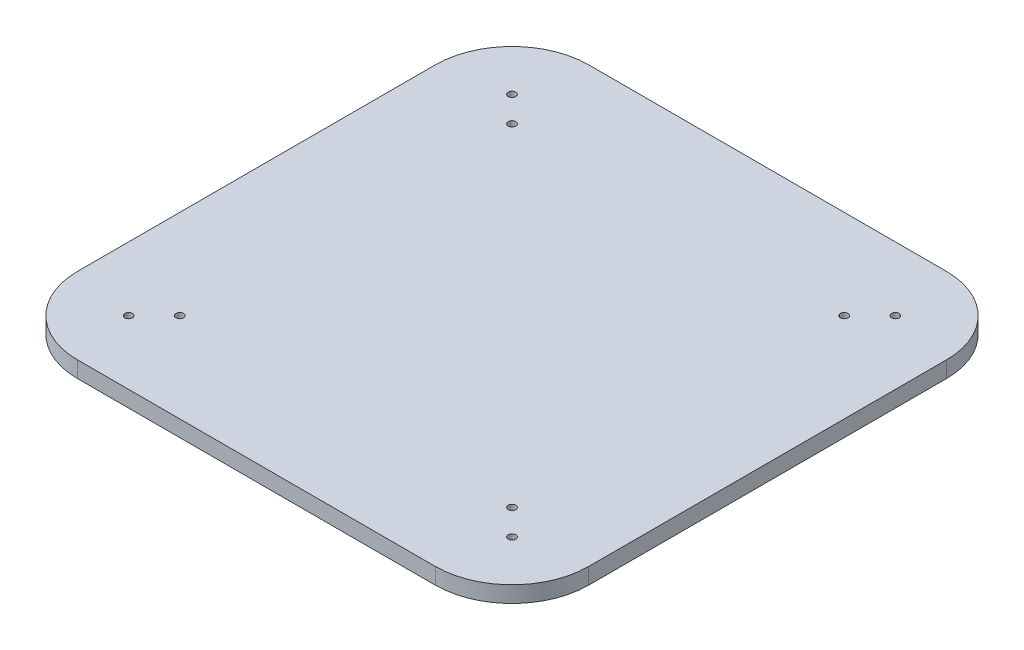
ISO-10303-21;
HEADER;
FILE_DESCRIPTION(('STEP AP214'),'2;1');
FILE_NAME('part.step','',(''),(''),'','','');
FILE_SCHEMA(('AUTOMOTIVE_DESIGN { 1 0 10303 214 1 1 1 1 }'));
ENDSEC;
DATA;
#1=APPLICATION_CONTEXT('core data for automotive mechanical design processes');
#2=APPLICATION_PROTOCOL_DEFINITION('international standard','automotive_design',2000,#1);
#3=PRODUCT_CONTEXT('',#1,'mechanical');
#4=PRODUCT('Part','Part','',(#3));
#5=PRODUCT_RELATED_PRODUCT_CATEGORY('part','',(#4));
#6=PRODUCT_DEFINITION_FORMATION('','',#4);
#7=PRODUCT_DEFINITION_CONTEXT('part definition',#1,'design');
#8=PRODUCT_DEFINITION('design','',#6,#7);
#9=PRODUCT_DEFINITION_SHAPE('','',#8);
#10=(LENGTH_UNIT() NAMED_UNIT(*) SI_UNIT(.MILLI.,.METRE.));
#11=(NAMED_UNIT(*) PLANE_ANGLE_UNIT() SI_UNIT($,.RADIAN.));
#12=(NAMED_UNIT(*) SI_UNIT($,.STERADIAN.) SOLID_ANGLE_UNIT());
#13=UNCERTAINTY_MEASURE_WITH_UNIT(LENGTH_MEASURE(1.E-05),#10,'distance_accuracy_value','');
#14=(GEOMETRIC_REPRESENTATION_CONTEXT(3) GLOBAL_UNCERTAINTY_ASSIGNED_CONTEXT((#13)) GLOBAL_UNIT_ASSIGNED_CONTEXT((#10,
#11,#12)) REPRESENTATION_CONTEXT('',''));
#15=CARTESIAN_POINT('',(0.,0.,0.));
#16=DIRECTION('',(0.,0.,1.));
#17=DIRECTION('',(1.,0.,0.));
#18=AXIS2_PLACEMENT_3D('',#15,#16,#17);
#19=CARTESIAN_POINT('',(70.,6.35,-70.));
#20=DIRECTION('',(0.,1.,0.));
#21=DIRECTION('',(0.,0.,1.));
#22=AXIS2_PLACEMENT_3D('',#19,#20,#21);
#23=PLANE('',#22);
#24=CARTESIAN_POINT('',(-75.0000000000001,6.35,-74.9999999999928));
#25=DIRECTION('',(0.,1.,0.));
#26=DIRECTION('',(0.,0.,1.));
#27=AXIS2_PLACEMENT_3D('',#24,#25,#26);
#28=CIRCLE('',#27,1.50000000000741);
#29=CARTESIAN_POINT('',(-75.0000000000001,6.35,-73.4999999999854));
#30=VERTEX_POINT('',#29);
#31=EDGE_CURVE('E212',#30,#30,#28,.T.);
#32=ORIENTED_EDGE('',*,*,#31,.F.);
#33=EDGE_LOOP('',(#32));
#34=FACE_BOUND('',#33,.T.);
#35=CARTESIAN_POINT('',(-74.9999999999928,6.35,75.0000000000073));
#36=DIRECTION('',(0.,1.,0.));
#37=DIRECTION('',(0.,0.,1.));
#38=AXIS2_PLACEMENT_3D('',#35,#36,#37);
#39=CIRCLE('',#38,1.50000000000514);
#40=CARTESIAN_POINT('',(-74.9999999999928,6.35,76.5000000000124));
#41=VERTEX_POINT('',#40);
#42=EDGE_CURVE('E200',#41,#41,#39,.T.);
#43=ORIENTED_EDGE('',*,*,#42,.F.);
#44=EDGE_LOOP('',(#43));
#45=FACE_BOUND('',#44,.T.);
#46=CARTESIAN_POINT('',(75.0000000000072,6.35,75.));
#47=DIRECTION('',(0.,1.,0.));
#48=DIRECTION('',(0.,0.,1.));
#49=AXIS2_PLACEMENT_3D('',#46,#47,#48);
#50=CIRCLE('',#49,1.49999999999804);
#51=CARTESIAN_POINT('',(75.0000000000072,6.35,76.4999999999981));
#52=VERTEX_POINT('',#51);
#53=EDGE_CURVE('E188',#52,#52,#50,.T.);
#54=ORIENTED_EDGE('',*,*,#53,.F.);
#55=EDGE_LOOP('',(#54));
#56=FACE_BOUND('',#55,.T.);
#57=CARTESIAN_POINT('',(75.,6.35,-75.));
#58=DIRECTION('',(0.,1.,0.));
#59=DIRECTION('',(0.,0.,1.));
#60=AXIS2_PLACEMENT_3D('',#57,#58,#59);
#61=CIRCLE('',#60,1.5);
#62=CARTESIAN_POINT('',(75.,6.35,-73.5));
#63=VERTEX_POINT('',#62);
#64=EDGE_CURVE('E134',#63,#63,#61,.T.);
#65=ORIENTED_EDGE('',*,*,#64,.F.);
#66=EDGE_LOOP('',(#65));
#67=FACE_BOUND('',#66,.T.);
#68=CARTESIAN_POINT('',(70.,6.35,-70.));
#69=DIRECTION('',(0.,1.,0.));
#70=DIRECTION('',(0.,0.,1.));
#71=AXIS2_PLACEMENT_3D('',#68,#69,#70);
#72=CIRCLE('',#71,30.);
#73=CARTESIAN_POINT('',(100.,6.35,-69.9999999999998));
#74=VERTEX_POINT('',#73);
#75=CARTESIAN_POINT('',(69.9999999999998,6.35,-100.));
#76=VERTEX_POINT('',#75);
#77=EDGE_CURVE('E145',#74,#76,#72,.T.);
#78=ORIENTED_EDGE('',*,*,#77,.T.);
#79=DIRECTION('',(-1.,0.,0.));
#80=VECTOR('',#79,1.);
#81=CARTESIAN_POINT('',(-69.9999999999998,6.35,-100.));
#82=LINE('',#81,#80);
#83=CARTESIAN_POINT('',(-70.,6.35,-100.));
#84=VERTEX_POINT('',#83);
#85=EDGE_CURVE('E93',#76,#84,#82,.T.);
#86=ORIENTED_EDGE('',*,*,#85,.T.);
#87=CARTESIAN_POINT('',(-70.,6.35,-70.));
#88=DIRECTION('',(0.,1.,0.));
#89=DIRECTION('',(0.,0.,-1.));
#90=AXIS2_PLACEMENT_3D('',#87,#88,#89);
#91=CIRCLE('',#90,30.);
#92=CARTESIAN_POINT('',(-100.,6.35,-69.9999999999998));
#93=VERTEX_POINT('',#92);
#94=EDGE_CURVE('E160',#84,#93,#91,.T.);
#95=ORIENTED_EDGE('',*,*,#94,.T.);
#96=DIRECTION('',(0.,0.,1.));
#97=VECTOR('',#96,1.);
#98=CARTESIAN_POINT('',(-100.,6.35,-69.9999999999998));
#99=LINE('',#98,#97);
#100=CARTESIAN_POINT('',(-100.,6.35,69.9999999999998));
#101=VERTEX_POINT('',#100);
#102=EDGE_CURVE('E173',#93,#101,#99,.T.);
#103=ORIENTED_EDGE('',*,*,#102,.T.);
#104=CARTESIAN_POINT('',(-70.,6.35,70.));
#105=DIRECTION('',(0.,1.,0.));
#106=DIRECTION('',(0.,0.,1.));
#107=AXIS2_PLACEMENT_3D('',#104,#105,#106);
#108=CIRCLE('',#107,30.);
#109=CARTESIAN_POINT('',(-69.9999999999998,6.35,100.));
#110=VERTEX_POINT('',#109);
#111=EDGE_CURVE('E112',#101,#110,#108,.T.);
#112=ORIENTED_EDGE('',*,*,#111,.T.);
#113=DIRECTION('',(1.,0.,0.));
#114=VECTOR('',#113,1.);
#115=CARTESIAN_POINT('',(-69.9999999999998,6.35,100.));
#116=LINE('',#115,#114);
#117=CARTESIAN_POINT('',(69.9999999999998,6.35,100.));
#118=VERTEX_POINT('',#117);
#119=EDGE_CURVE('E106',#110,#118,#116,.T.);
#120=ORIENTED_EDGE('',*,*,#119,.T.);
#121=CARTESIAN_POINT('',(70.,6.35,70.));
#122=DIRECTION('',(0.,1.,0.));
#123=DIRECTION('',(0.,0.,-1.));
#124=AXIS2_PLACEMENT_3D('',#121,#122,#123);
#125=CIRCLE('',#124,30.);
#126=CARTESIAN_POINT('',(100.,6.35,69.9999999999998));
#127=VERTEX_POINT('',#126);
#128=EDGE_CURVE('E110',#118,#127,#125,.T.);
#129=ORIENTED_EDGE('',*,*,#128,.T.);
#130=DIRECTION('',(0.,0.,-1.));
#131=VECTOR('',#130,1.);
#132=CARTESIAN_POINT('',(100.,6.35,-69.9999999999998));
#133=LINE('',#132,#131);
#134=EDGE_CURVE('E50',#127,#74,#133,.T.);
#135=ORIENTED_EDGE('',*,*,#134,.T.);
#136=EDGE_LOOP('',(#78,#86,#95,#103,#112,#120,#129,#135));
#137=FACE_BOUND('',#136,.T.);
#138=CARTESIAN_POINT('',(65.,6.35,-65.0000000000001));
#139=DIRECTION('',(0.,1.,0.));
#140=DIRECTION('',(0.,0.,1.));
#141=AXIS2_PLACEMENT_3D('',#138,#139,#140);
#142=CIRCLE('',#141,1.5);
#143=CARTESIAN_POINT('',(65.,6.35,-63.5000000000001));
#144=VERTEX_POINT('',#143);
#145=EDGE_CURVE('E182',#144,#144,#142,.T.);
#146=ORIENTED_EDGE('',*,*,#145,.F.);
#147=EDGE_LOOP('',(#146));
#148=FACE_BOUND('',#147,.T.);
#149=CARTESIAN_POINT('',(65.0000000000073,6.35,65.));
#150=DIRECTION('',(0.,1.,0.));
#151=DIRECTION('',(0.,0.,1.));
#152=AXIS2_PLACEMENT_3D('',#149,#150,#151);
#153=CIRCLE('',#152,1.49999999999801);
#154=CARTESIAN_POINT('',(65.0000000000073,6.35,66.499999999998));
#155=VERTEX_POINT('',#154);
#156=EDGE_CURVE('E194',#155,#155,#153,.T.);
#157=ORIENTED_EDGE('',*,*,#156,.F.);
#158=EDGE_LOOP('',(#157));
#159=FACE_BOUND('',#158,.T.);
#160=CARTESIAN_POINT('',(-64.9999999999928,6.35,65.0000000000073));
#161=DIRECTION('',(0.,1.,0.));
#162=DIRECTION('',(0.,0.,1.));
#163=AXIS2_PLACEMENT_3D('',#160,#161,#162);
#164=CIRCLE('',#163,1.50000000000509);
#165=CARTESIAN_POINT('',(-64.9999999999928,6.35,66.5000000000124));
#166=VERTEX_POINT('',#165);
#167=EDGE_CURVE('E206',#166,#166,#164,.T.);
#168=ORIENTED_EDGE('',*,*,#167,.F.);
#169=EDGE_LOOP('',(#168));
#170=FACE_BOUND('',#169,.T.);
#171=CARTESIAN_POINT('',(-65.0000000000001,6.35,-64.9999999999928));
#172=DIRECTION('',(0.,1.,0.));
#173=DIRECTION('',(0.,0.,1.));
#174=AXIS2_PLACEMENT_3D('',#171,#172,#173);
#175=CIRCLE('',#174,1.50000000000734);
#176=CARTESIAN_POINT('',(-65.0000000000001,6.35,-63.4999999999854));
#177=VERTEX_POINT('',#176);
#178=EDGE_CURVE('E218',#177,#177,#175,.T.);
#179=ORIENTED_EDGE('',*,*,#178,.F.);
#180=EDGE_LOOP('',(#179));
#181=FACE_BOUND('',#180,.T.);
#182=ADVANCED_FACE('F33',(#34,#45,#56,#67,#137,#148,#159,#170,#181),#23,.T.);
#183=CARTESIAN_POINT('',(70.,0.,-70.));
#184=DIRECTION('',(0.,1.,0.));
#185=DIRECTION('',(0.,0.,1.));
#186=AXIS2_PLACEMENT_3D('',#183,#184,#185);
#187=PLANE('',#186);
#188=CARTESIAN_POINT('',(70.,0.,-70.));
#189=DIRECTION('',(0.,1.,0.));
#190=DIRECTION('',(0.,0.,1.));
#191=AXIS2_PLACEMENT_3D('',#188,#189,#190);
#192=CIRCLE('',#191,30.);
#193=CARTESIAN_POINT('',(100.,0.,-69.9999999999998));
#194=VERTEX_POINT('',#193);
#195=CARTESIAN_POINT('',(69.9999999999998,0.,-100.));
#196=VERTEX_POINT('',#195);
#197=EDGE_CURVE('E130',#194,#196,#192,.T.);
#198=ORIENTED_EDGE('',*,*,#197,.F.);
#199=DIRECTION('',(0.,0.,-1.));
#200=VECTOR('',#199,1.);
#201=CARTESIAN_POINT('',(100.,0.,-69.9999999999998));
#202=LINE('',#201,#200);
#203=CARTESIAN_POINT('',(100.,0.,69.9999999999998));
#204=VERTEX_POINT('',#203);
#205=EDGE_CURVE('E85',#204,#194,#202,.T.);
#206=ORIENTED_EDGE('',*,*,#205,.F.);
#207=CARTESIAN_POINT('',(70.,0.,70.));
#208=DIRECTION('',(0.,1.,0.));
#209=DIRECTION('',(0.,0.,-1.));
#210=AXIS2_PLACEMENT_3D('',#207,#208,#209);
#211=CIRCLE('',#210,30.);
#212=CARTESIAN_POINT('',(69.9999999999998,0.,100.));
#213=VERTEX_POINT('',#212);
#214=EDGE_CURVE('E79',#213,#204,#211,.T.);
#215=ORIENTED_EDGE('',*,*,#214,.F.);
#216=DIRECTION('',(1.,0.,0.));
#217=VECTOR('',#216,1.);
#218=CARTESIAN_POINT('',(-69.9999999999998,0.,100.));
#219=LINE('',#218,#217);
#220=CARTESIAN_POINT('',(-69.9999999999998,0.,100.));
#221=VERTEX_POINT('',#220);
#222=EDGE_CURVE('E120',#221,#213,#219,.T.);
#223=ORIENTED_EDGE('',*,*,#222,.F.);
#224=CARTESIAN_POINT('',(-70.,0.,70.));
#225=DIRECTION('',(0.,1.,0.));
#226=DIRECTION('',(0.,0.,1.));
#227=AXIS2_PLACEMENT_3D('',#224,#225,#226);
#228=CIRCLE('',#227,30.);
#229=CARTESIAN_POINT('',(-100.,0.,69.9999999999998));
#230=VERTEX_POINT('',#229);
#231=EDGE_CURVE('E140',#230,#221,#228,.T.);
#232=ORIENTED_EDGE('',*,*,#231,.F.);
#233=DIRECTION('',(0.,0.,1.));
#234=VECTOR('',#233,1.);
#235=CARTESIAN_POINT('',(-100.,0.,-69.9999999999998));
#236=LINE('',#235,#234);
#237=CARTESIAN_POINT('',(-100.,0.,-69.9999999999998));
#238=VERTEX_POINT('',#237);
#239=EDGE_CURVE('E138',#238,#230,#236,.T.);
#240=ORIENTED_EDGE('',*,*,#239,.F.);
#241=CARTESIAN_POINT('',(-70.,0.,-70.));
#242=DIRECTION('',(0.,1.,0.));
#243=DIRECTION('',(0.,0.,-1.));
#244=AXIS2_PLACEMENT_3D('',#241,#242,#243);
#245=CIRCLE('',#244,30.);
#246=CARTESIAN_POINT('',(-70.,0.,-100.));
#247=VERTEX_POINT('',#246);
#248=EDGE_CURVE('E136',#247,#238,#245,.T.);
#249=ORIENTED_EDGE('',*,*,#248,.F.);
#250=DIRECTION('',(-1.,0.,0.));
#251=VECTOR('',#250,1.);
#252=CARTESIAN_POINT('',(-69.9999999999998,0.,-100.));
#253=LINE('',#252,#251);
#254=EDGE_CURVE('E133',#196,#247,#253,.T.);
#255=ORIENTED_EDGE('',*,*,#254,.F.);
#256=EDGE_LOOP('',(#198,#206,#215,#223,#232,#240,#249,#255));
#257=FACE_BOUND('',#256,.T.);
#258=CARTESIAN_POINT('',(75.,0.,-75.));
#259=DIRECTION('',(0.,1.,0.));
#260=DIRECTION('',(0.,0.,1.));
#261=AXIS2_PLACEMENT_3D('',#258,#259,#260);
#262=CIRCLE('',#261,1.5);
#263=CARTESIAN_POINT('',(75.,0.,-73.5));
#264=VERTEX_POINT('',#263);
#265=EDGE_CURVE('E179',#264,#264,#262,.T.);
#266=ORIENTED_EDGE('',*,*,#265,.T.);
#267=EDGE_LOOP('',(#266));
#268=FACE_BOUND('',#267,.T.);
#269=CARTESIAN_POINT('',(65.,0.,-65.0000000000001));
#270=DIRECTION('',(0.,1.,0.));
#271=DIRECTION('',(0.,0.,1.));
#272=AXIS2_PLACEMENT_3D('',#269,#270,#271);
#273=CIRCLE('',#272,1.5);
#274=CARTESIAN_POINT('',(65.,0.,-63.5000000000001));
#275=VERTEX_POINT('',#274);
#276=EDGE_CURVE('E185',#275,#275,#273,.T.);
#277=ORIENTED_EDGE('',*,*,#276,.T.);
#278=EDGE_LOOP('',(#277));
#279=FACE_BOUND('',#278,.T.);
#280=CARTESIAN_POINT('',(75.0000000000072,0.,75.));
#281=DIRECTION('',(0.,1.,0.));
#282=DIRECTION('',(0.,0.,1.));
#283=AXIS2_PLACEMENT_3D('',#280,#281,#282);
#284=CIRCLE('',#283,1.49999999999804);
#285=CARTESIAN_POINT('',(75.0000000000072,0.,76.4999999999981));
#286=VERTEX_POINT('',#285);
#287=EDGE_CURVE('E191',#286,#286,#284,.T.);
#288=ORIENTED_EDGE('',*,*,#287,.T.);
#289=EDGE_LOOP('',(#288));
#290=FACE_BOUND('',#289,.T.);
#291=CARTESIAN_POINT('',(65.0000000000073,0.,65.));
#292=DIRECTION('',(0.,1.,0.));
#293=DIRECTION('',(0.,0.,1.));
#294=AXIS2_PLACEMENT_3D('',#291,#292,#293);
#295=CIRCLE('',#294,1.49999999999801);
#296=CARTESIAN_POINT('',(65.0000000000073,0.,66.499999999998));
#297=VERTEX_POINT('',#296);
#298=EDGE_CURVE('E197',#297,#297,#295,.T.);
#299=ORIENTED_EDGE('',*,*,#298,.T.);
#300=EDGE_LOOP('',(#299));
#301=FACE_BOUND('',#300,.T.);
#302=CARTESIAN_POINT('',(-74.9999999999928,0.,75.0000000000073));
#303=DIRECTION('',(0.,1.,0.));
#304=DIRECTION('',(0.,0.,1.));
#305=AXIS2_PLACEMENT_3D('',#302,#303,#304);
#306=CIRCLE('',#305,1.50000000000514);
#307=CARTESIAN_POINT('',(-74.9999999999928,0.,76.5000000000124));
#308=VERTEX_POINT('',#307);
#309=EDGE_CURVE('E203',#308,#308,#306,.T.);
#310=ORIENTED_EDGE('',*,*,#309,.T.);
#311=EDGE_LOOP('',(#310));
#312=FACE_BOUND('',#311,.T.);
#313=CARTESIAN_POINT('',(-64.9999999999928,0.,65.0000000000073));
#314=DIRECTION('',(0.,1.,0.));
#315=DIRECTION('',(0.,0.,1.));
#316=AXIS2_PLACEMENT_3D('',#313,#314,#315);
#317=CIRCLE('',#316,1.50000000000509);
#318=CARTESIAN_POINT('',(-64.9999999999928,0.,66.5000000000124));
#319=VERTEX_POINT('',#318);
#320=EDGE_CURVE('E209',#319,#319,#317,.T.);
#321=ORIENTED_EDGE('',*,*,#320,.T.);
#322=EDGE_LOOP('',(#321));
#323=FACE_BOUND('',#322,.T.);
#324=CARTESIAN_POINT('',(-75.0000000000001,0.,-74.9999999999928));
#325=DIRECTION('',(0.,1.,0.));
#326=DIRECTION('',(0.,0.,1.));
#327=AXIS2_PLACEMENT_3D('',#324,#325,#326);
#328=CIRCLE('',#327,1.50000000000741);
#329=CARTESIAN_POINT('',(-75.0000000000001,0.,-73.4999999999854));
#330=VERTEX_POINT('',#329);
#331=EDGE_CURVE('E215',#330,#330,#328,.T.);
#332=ORIENTED_EDGE('',*,*,#331,.T.);
#333=EDGE_LOOP('',(#332));
#334=FACE_BOUND('',#333,.T.);
#335=CARTESIAN_POINT('',(-65.0000000000001,0.,-64.9999999999928));
#336=DIRECTION('',(0.,1.,0.));
#337=DIRECTION('',(0.,0.,1.));
#338=AXIS2_PLACEMENT_3D('',#335,#336,#337);
#339=CIRCLE('',#338,1.50000000000734);
#340=CARTESIAN_POINT('',(-65.0000000000001,0.,-63.4999999999854));
#341=VERTEX_POINT('',#340);
#342=EDGE_CURVE('E221',#341,#341,#339,.T.);
#343=ORIENTED_EDGE('',*,*,#342,.T.);
#344=EDGE_LOOP('',(#343));
#345=FACE_BOUND('',#344,.T.);
#346=ADVANCED_FACE('F164',(#257,#268,#279,#290,#301,#312,#323,#334,#345),#187,.F.);
#347=CARTESIAN_POINT('',(70.,6.35,-70.));
#348=DIRECTION('',(0.,-1.,0.));
#349=DIRECTION('',(0.,0.,-1.));
#350=AXIS2_PLACEMENT_3D('',#347,#348,#349);
#351=CYLINDRICAL_SURFACE('',#350,30.);
#352=ORIENTED_EDGE('',*,*,#197,.T.);
#353=DIRECTION('',(0.,-1.,0.));
#354=VECTOR('',#353,1.);
#355=CARTESIAN_POINT('',(69.9999999999998,6.35,-100.));
#356=LINE('',#355,#354);
#357=EDGE_CURVE('E11',#76,#196,#356,.T.);
#358=ORIENTED_EDGE('',*,*,#357,.F.);
#359=ORIENTED_EDGE('',*,*,#77,.F.);
#360=DIRECTION('',(0.,-1.,0.));
#361=VECTOR('',#360,1.);
#362=CARTESIAN_POINT('',(100.,6.35,-69.9999999999998));
#363=LINE('',#362,#361);
#364=EDGE_CURVE('E126',#74,#194,#363,.T.);
#365=ORIENTED_EDGE('',*,*,#364,.T.);
#366=EDGE_LOOP('',(#352,#358,#359,#365));
#367=FACE_BOUND('',#366,.T.);
#368=ADVANCED_FACE('F35',(#367),#351,.T.);
#369=CARTESIAN_POINT('',(-69.9999999999998,6.35,-100.));
#370=DIRECTION('',(0.,0.,1.));
#371=DIRECTION('',(1.,0.,0.));
#372=AXIS2_PLACEMENT_3D('',#369,#370,#371);
#373=PLANE('',#372);
#374=ORIENTED_EDGE('',*,*,#254,.T.);
#375=DIRECTION('',(0.,-1.,0.));
#376=VECTOR('',#375,1.);
#377=CARTESIAN_POINT('',(-70.,6.35,-100.));
#378=LINE('',#377,#376);
#379=EDGE_CURVE('E42',#84,#247,#378,.T.);
#380=ORIENTED_EDGE('',*,*,#379,.F.);
#381=ORIENTED_EDGE('',*,*,#85,.F.);
#382=ORIENTED_EDGE('',*,*,#357,.T.);
#383=EDGE_LOOP('',(#374,#380,#381,#382));
#384=FACE_BOUND('',#383,.T.);
#385=ADVANCED_FACE('F255',(#384),#373,.F.);
#386=CARTESIAN_POINT('',(-70.,6.35,-70.));
#387=DIRECTION('',(0.,-1.,0.));
#388=DIRECTION('',(0.,0.,-1.));
#389=AXIS2_PLACEMENT_3D('',#386,#387,#388);
#390=CYLINDRICAL_SURFACE('',#389,30.);
#391=ORIENTED_EDGE('',*,*,#248,.T.);
#392=DIRECTION('',(0.,-1.,0.));
#393=VECTOR('',#392,1.);
#394=CARTESIAN_POINT('',(-100.,6.35,-69.9999999999998));
#395=LINE('',#394,#393);
#396=EDGE_CURVE('E152',#93,#238,#395,.T.);
#397=ORIENTED_EDGE('',*,*,#396,.F.);
#398=ORIENTED_EDGE('',*,*,#94,.F.);
#399=ORIENTED_EDGE('',*,*,#379,.T.);
#400=EDGE_LOOP('',(#391,#397,#398,#399));
#401=FACE_BOUND('',#400,.T.);
#402=ADVANCED_FACE('F158',(#401),#390,.T.);
#403=CARTESIAN_POINT('',(-100.,6.35,-69.9999999999998));
#404=DIRECTION('',(1.,0.,0.));
#405=DIRECTION('',(0.,0.,-1.));
#406=AXIS2_PLACEMENT_3D('',#403,#404,#405);
#407=PLANE('',#406);
#408=ORIENTED_EDGE('',*,*,#239,.T.);
#409=DIRECTION('',(0.,-1.,0.));
#410=VECTOR('',#409,1.);
#411=CARTESIAN_POINT('',(-100.,6.35,69.9999999999998));
#412=LINE('',#411,#410);
#413=EDGE_CURVE('E149',#101,#230,#412,.T.);
#414=ORIENTED_EDGE('',*,*,#413,.F.);
#415=ORIENTED_EDGE('',*,*,#102,.F.);
#416=ORIENTED_EDGE('',*,*,#396,.T.);
#417=EDGE_LOOP('',(#408,#414,#415,#416));
#418=FACE_BOUND('',#417,.T.);
#419=ADVANCED_FACE('F169',(#418),#407,.F.);
#420=CARTESIAN_POINT('',(-70.,6.35,70.));
#421=DIRECTION('',(0.,-1.,0.));
#422=DIRECTION('',(0.,0.,-1.));
#423=AXIS2_PLACEMENT_3D('',#420,#421,#422);
#424=CYLINDRICAL_SURFACE('',#423,30.);
#425=ORIENTED_EDGE('',*,*,#231,.T.);
#426=DIRECTION('',(0.,-1.,0.));
#427=VECTOR('',#426,1.);
#428=CARTESIAN_POINT('',(-69.9999999999998,6.35,100.));
#429=LINE('',#428,#427);
#430=EDGE_CURVE('E121',#110,#221,#429,.T.);
#431=ORIENTED_EDGE('',*,*,#430,.F.);
#432=ORIENTED_EDGE('',*,*,#111,.F.);
#433=ORIENTED_EDGE('',*,*,#413,.T.);
#434=EDGE_LOOP('',(#425,#431,#432,#433));
#435=FACE_BOUND('',#434,.T.);
#436=ADVANCED_FACE('F172',(#435),#424,.T.);
#437=CARTESIAN_POINT('',(-69.9999999999998,6.35,100.));
#438=DIRECTION('',(0.,0.,-1.));
#439=DIRECTION('',(-1.,0.,0.));
#440=AXIS2_PLACEMENT_3D('',#437,#438,#439);
#441=PLANE('',#440);
#442=ORIENTED_EDGE('',*,*,#222,.T.);
#443=DIRECTION('',(0.,-1.,0.));
#444=VECTOR('',#443,1.);
#445=CARTESIAN_POINT('',(69.9999999999998,6.35,100.));
#446=LINE('',#445,#444);
#447=EDGE_CURVE('E117',#118,#213,#446,.T.);
#448=ORIENTED_EDGE('',*,*,#447,.F.);
#449=ORIENTED_EDGE('',*,*,#119,.F.);
#450=ORIENTED_EDGE('',*,*,#430,.T.);
#451=EDGE_LOOP('',(#442,#448,#449,#450));
#452=FACE_BOUND('',#451,.T.);
#453=ADVANCED_FACE('F118',(#452),#441,.F.);
#454=CARTESIAN_POINT('',(70.,6.35,70.));
#455=DIRECTION('',(0.,-1.,0.));
#456=DIRECTION('',(0.,0.,-1.));
#457=AXIS2_PLACEMENT_3D('',#454,#455,#456);
#458=CYLINDRICAL_SURFACE('',#457,30.);
#459=ORIENTED_EDGE('',*,*,#214,.T.);
#460=DIRECTION('',(0.,-1.,0.));
#461=VECTOR('',#460,1.);
#462=CARTESIAN_POINT('',(100.,6.35,69.9999999999998));
#463=LINE('',#462,#461);
#464=EDGE_CURVE('E122',#127,#204,#463,.T.);
#465=ORIENTED_EDGE('',*,*,#464,.F.);
#466=ORIENTED_EDGE('',*,*,#128,.F.);
#467=ORIENTED_EDGE('',*,*,#447,.T.);
#468=EDGE_LOOP('',(#459,#465,#466,#467));
#469=FACE_BOUND('',#468,.T.);
#470=ADVANCED_FACE('F124',(#469),#458,.T.);
#471=CARTESIAN_POINT('',(100.,6.35,-69.9999999999998));
#472=DIRECTION('',(-1.,0.,0.));
#473=DIRECTION('',(0.,0.,1.));
#474=AXIS2_PLACEMENT_3D('',#471,#472,#473);
#475=PLANE('',#474);
#476=ORIENTED_EDGE('',*,*,#205,.T.);
#477=ORIENTED_EDGE('',*,*,#364,.F.);
#478=ORIENTED_EDGE('',*,*,#134,.F.);
#479=ORIENTED_EDGE('',*,*,#464,.T.);
#480=EDGE_LOOP('',(#476,#477,#478,#479));
#481=FACE_BOUND('',#480,.T.);
#482=ADVANCED_FACE('F243',(#481),#475,.F.);
#483=CARTESIAN_POINT('',(75.,6.35,-75.));
#484=DIRECTION('',(0.,-1.,0.));
#485=DIRECTION('',(0.,0.,-1.));
#486=AXIS2_PLACEMENT_3D('',#483,#484,#485);
#487=CYLINDRICAL_SURFACE('',#486,1.5);
#488=ORIENTED_EDGE('',*,*,#64,.T.);
#489=EDGE_LOOP('',(#488));
#490=FACE_BOUND('',#489,.T.);
#491=ORIENTED_EDGE('',*,*,#265,.F.);
#492=EDGE_LOOP('',(#491));
#493=FACE_BOUND('',#492,.T.);
#494=ADVANCED_FACE('F240',(#490,#493),#487,.F.);
#495=CARTESIAN_POINT('',(65.,6.35,-65.0000000000001));
#496=DIRECTION('',(0.,-1.,0.));
#497=DIRECTION('',(0.,0.,-1.));
#498=AXIS2_PLACEMENT_3D('',#495,#496,#497);
#499=CYLINDRICAL_SURFACE('',#498,1.5);
#500=ORIENTED_EDGE('',*,*,#145,.T.);
#501=EDGE_LOOP('',(#500));
#502=FACE_BOUND('',#501,.T.);
#503=ORIENTED_EDGE('',*,*,#276,.F.);
#504=EDGE_LOOP('',(#503));
#505=FACE_BOUND('',#504,.T.);
#506=ADVANCED_FACE('F319',(#502,#505),#499,.F.);
#507=CARTESIAN_POINT('',(75.0000000000072,6.35,75.));
#508=DIRECTION('',(0.,-1.,0.));
#509=DIRECTION('',(0.,0.,-1.));
#510=AXIS2_PLACEMENT_3D('',#507,#508,#509);
#511=CYLINDRICAL_SURFACE('',#510,1.49999999999804);
#512=ORIENTED_EDGE('',*,*,#53,.T.);
#513=EDGE_LOOP('',(#512));
#514=FACE_BOUND('',#513,.T.);
#515=ORIENTED_EDGE('',*,*,#287,.F.);
#516=EDGE_LOOP('',(#515));
#517=FACE_BOUND('',#516,.T.);
#518=ADVANCED_FACE('F327',(#514,#517),#511,.F.);
#519=CARTESIAN_POINT('',(65.0000000000073,6.35,65.));
#520=DIRECTION('',(0.,-1.,0.));
#521=DIRECTION('',(0.,0.,-1.));
#522=AXIS2_PLACEMENT_3D('',#519,#520,#521);
#523=CYLINDRICAL_SURFACE('',#522,1.49999999999801);
#524=ORIENTED_EDGE('',*,*,#156,.T.);
#525=EDGE_LOOP('',(#524));
#526=FACE_BOUND('',#525,.T.);
#527=ORIENTED_EDGE('',*,*,#298,.F.);
#528=EDGE_LOOP('',(#527));
#529=FACE_BOUND('',#528,.T.);
#530=ADVANCED_FACE('F335',(#526,#529),#523,.F.);
#531=CARTESIAN_POINT('',(-74.9999999999928,6.35,75.0000000000073));
#532=DIRECTION('',(0.,-1.,0.));
#533=DIRECTION('',(0.,0.,-1.));
#534=AXIS2_PLACEMENT_3D('',#531,#532,#533);
#535=CYLINDRICAL_SURFACE('',#534,1.50000000000514);
#536=ORIENTED_EDGE('',*,*,#42,.T.);
#537=EDGE_LOOP('',(#536));
#538=FACE_BOUND('',#537,.T.);
#539=ORIENTED_EDGE('',*,*,#309,.F.);
#540=EDGE_LOOP('',(#539));
#541=FACE_BOUND('',#540,.T.);
#542=ADVANCED_FACE('F344',(#538,#541),#535,.F.);
#543=CARTESIAN_POINT('',(-64.9999999999928,6.35,65.0000000000073));
#544=DIRECTION('',(0.,-1.,0.));
#545=DIRECTION('',(0.,0.,-1.));
#546=AXIS2_PLACEMENT_3D('',#543,#544,#545);
#547=CYLINDRICAL_SURFACE('',#546,1.50000000000509);
#548=ORIENTED_EDGE('',*,*,#167,.T.);
#549=EDGE_LOOP('',(#548));
#550=FACE_BOUND('',#549,.T.);
#551=ORIENTED_EDGE('',*,*,#320,.F.);
#552=EDGE_LOOP('',(#551));
#553=FACE_BOUND('',#552,.T.);
#554=ADVANCED_FACE('F353',(#550,#553),#547,.F.);
#555=CARTESIAN_POINT('',(-75.0000000000001,6.35,-74.9999999999928));
#556=DIRECTION('',(0.,-1.,0.));
#557=DIRECTION('',(0.,0.,-1.));
#558=AXIS2_PLACEMENT_3D('',#555,#556,#557);
#559=CYLINDRICAL_SURFACE('',#558,1.50000000000741);
#560=ORIENTED_EDGE('',*,*,#31,.T.);
#561=EDGE_LOOP('',(#560));
#562=FACE_BOUND('',#561,.T.);
#563=ORIENTED_EDGE('',*,*,#331,.F.);
#564=EDGE_LOOP('',(#563));
#565=FACE_BOUND('',#564,.T.);
#566=ADVANCED_FACE('F362',(#562,#565),#559,.F.);
#567=CARTESIAN_POINT('',(-65.0000000000001,6.35,-64.9999999999928));
#568=DIRECTION('',(0.,-1.,0.));
#569=DIRECTION('',(0.,0.,-1.));
#570=AXIS2_PLACEMENT_3D('',#567,#568,#569);
#571=CYLINDRICAL_SURFACE('',#570,1.50000000000734);
#572=ORIENTED_EDGE('',*,*,#178,.T.);
#573=EDGE_LOOP('',(#572));
#574=FACE_BOUND('',#573,.T.);
#575=ORIENTED_EDGE('',*,*,#342,.F.);
#576=EDGE_LOOP('',(#575));
#577=FACE_BOUND('',#576,.T.);
#578=ADVANCED_FACE('F227',(#574,#577),#571,.F.);
#579=CLOSED_SHELL('',(#182,#346,#368,#385,#402,#419,#436,#453,#470,#482,#494,#506,#518,#530,
#542,#554,#566,#578));
#580=MANIFOLD_SOLID_BREP('B2',#579);
#581=ADVANCED_BREP_SHAPE_REPRESENTATION('',(#18,#580),#14);
#582=SHAPE_DEFINITION_REPRESENTATION(#9,#581);
ENDSEC;
END-ISO-10303-21;
